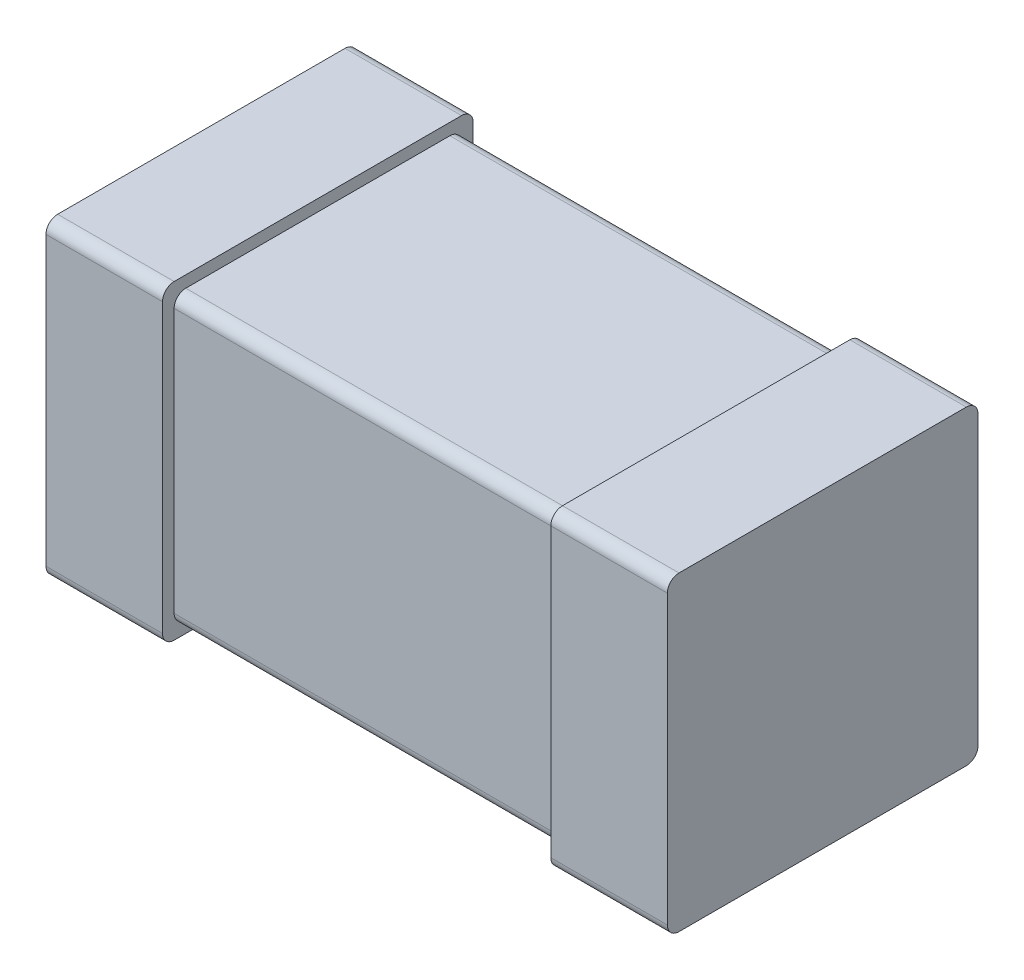
ISO-10303-21;
HEADER;
FILE_DESCRIPTION(('STEP AP214'),'2;1');
FILE_NAME('part.step','',(''),(''),'','','');
FILE_SCHEMA(('AUTOMOTIVE_DESIGN { 1 0 10303 214 1 1 1 1 }'));
ENDSEC;
DATA;
#1=APPLICATION_CONTEXT('core data for automotive mechanical design processes');
#2=APPLICATION_PROTOCOL_DEFINITION('international standard','automotive_design',2000,#1);
#3=PRODUCT_CONTEXT('',#1,'mechanical');
#4=PRODUCT('Part','Part','',(#3));
#5=PRODUCT_RELATED_PRODUCT_CATEGORY('part','',(#4));
#6=PRODUCT_DEFINITION_FORMATION('','',#4);
#7=PRODUCT_DEFINITION_CONTEXT('part definition',#1,'design');
#8=PRODUCT_DEFINITION('design','',#6,#7);
#9=PRODUCT_DEFINITION_SHAPE('','',#8);
#10=(LENGTH_UNIT() NAMED_UNIT(*) SI_UNIT(.MILLI.,.METRE.));
#11=(NAMED_UNIT(*) PLANE_ANGLE_UNIT() SI_UNIT($,.RADIAN.));
#12=(NAMED_UNIT(*) SI_UNIT($,.STERADIAN.) SOLID_ANGLE_UNIT());
#13=UNCERTAINTY_MEASURE_WITH_UNIT(LENGTH_MEASURE(1.E-05),#10,'distance_accuracy_value','');
#14=(GEOMETRIC_REPRESENTATION_CONTEXT(3) GLOBAL_UNCERTAINTY_ASSIGNED_CONTEXT((#13)) GLOBAL_UNIT_ASSIGNED_CONTEXT((#10,
#11,#12)) REPRESENTATION_CONTEXT('',''));
#15=CARTESIAN_POINT('',(0.,0.,0.));
#16=DIRECTION('',(0.,0.,1.));
#17=DIRECTION('',(1.,0.,0.));
#18=AXIS2_PLACEMENT_3D('',#15,#16,#17);
#19=CARTESIAN_POINT('',(0.8,-0.4,0.));
#20=DIRECTION('',(1.,0.,0.));
#21=DIRECTION('',(0.,1.,0.));
#22=AXIS2_PLACEMENT_3D('',#19,#20,#21);
#23=PLANE('',#22);
#24=DIRECTION('',(0.,0.,1.));
#25=VECTOR('',#24,1.);
#26=CARTESIAN_POINT('',(0.8,-0.4,0.));
#27=LINE('',#26,#25);
#28=CARTESIAN_POINT('',(0.8,-0.4,0.03));
#29=VERTEX_POINT('',#28);
#30=CARTESIAN_POINT('',(0.8,-0.4,0.77));
#31=VERTEX_POINT('',#30);
#32=EDGE_CURVE('E292',#29,#31,#27,.T.);
#33=ORIENTED_EDGE('',*,*,#32,.F.);
#34=CARTESIAN_POINT('',(0.8,-0.37,0.03));
#35=DIRECTION('',(1.,0.,0.));
#36=DIRECTION('',(0.,0.,1.));
#37=AXIS2_PLACEMENT_3D('',#34,#35,#36);
#38=CIRCLE('',#37,0.03);
#39=CARTESIAN_POINT('',(0.8,-0.37,0.));
#40=VERTEX_POINT('',#39);
#41=EDGE_CURVE('E297',#29,#40,#38,.T.);
#42=ORIENTED_EDGE('',*,*,#41,.T.);
#43=DIRECTION('',(0.,1.,0.));
#44=VECTOR('',#43,1.);
#45=CARTESIAN_POINT('',(0.8,-0.4,0.));
#46=LINE('',#45,#44);
#47=CARTESIAN_POINT('',(0.8,0.37,0.));
#48=VERTEX_POINT('',#47);
#49=EDGE_CURVE('E310',#40,#48,#46,.T.);
#50=ORIENTED_EDGE('',*,*,#49,.T.);
#51=CARTESIAN_POINT('',(0.8,0.37,0.03));
#52=DIRECTION('',(-1.,0.,0.));
#53=DIRECTION('',(0.,0.,1.));
#54=AXIS2_PLACEMENT_3D('',#51,#52,#53);
#55=CIRCLE('',#54,0.03);
#56=CARTESIAN_POINT('',(0.8,0.4,0.03));
#57=VERTEX_POINT('',#56);
#58=EDGE_CURVE('E320',#57,#48,#55,.T.);
#59=ORIENTED_EDGE('',*,*,#58,.F.);
#60=DIRECTION('',(0.,0.,1.));
#61=VECTOR('',#60,1.);
#62=CARTESIAN_POINT('',(0.8,0.4,0.));
#63=LINE('',#62,#61);
#64=CARTESIAN_POINT('',(0.8,0.4,0.77));
#65=VERTEX_POINT('',#64);
#66=EDGE_CURVE('E11',#57,#65,#63,.T.);
#67=ORIENTED_EDGE('',*,*,#66,.T.);
#68=CARTESIAN_POINT('',(0.8,0.37,0.77));
#69=DIRECTION('',(1.,0.,0.));
#70=DIRECTION('',(0.,0.,1.));
#71=AXIS2_PLACEMENT_3D('',#68,#69,#70);
#72=CIRCLE('',#71,0.03);
#73=CARTESIAN_POINT('',(0.8,0.37,0.8));
#74=VERTEX_POINT('',#73);
#75=EDGE_CURVE('E322',#65,#74,#72,.T.);
#76=ORIENTED_EDGE('',*,*,#75,.T.);
#77=DIRECTION('',(0.,1.,0.));
#78=VECTOR('',#77,1.);
#79=CARTESIAN_POINT('',(0.8,-0.4,0.8));
#80=LINE('',#79,#78);
#81=CARTESIAN_POINT('',(0.8,-0.37,0.8));
#82=VERTEX_POINT('',#81);
#83=EDGE_CURVE('E316',#82,#74,#80,.T.);
#84=ORIENTED_EDGE('',*,*,#83,.F.);
#85=CARTESIAN_POINT('',(0.8,-0.37,0.77));
#86=DIRECTION('',(-1.,0.,0.));
#87=DIRECTION('',(0.,0.,1.));
#88=AXIS2_PLACEMENT_3D('',#85,#86,#87);
#89=CIRCLE('',#88,0.03);
#90=EDGE_CURVE('E301',#31,#82,#89,.T.);
#91=ORIENTED_EDGE('',*,*,#90,.F.);
#92=EDGE_LOOP('',(#33,#42,#50,#59,#67,#76,#84,#91));
#93=FACE_BOUND('',#92,.T.);
#94=ADVANCED_FACE('F17',(#93),#23,.T.);
#95=CARTESIAN_POINT('',(0.5,0.4,0.));
#96=DIRECTION('',(0.,1.,0.));
#97=DIRECTION('',(1.,0.,0.));
#98=AXIS2_PLACEMENT_3D('',#95,#96,#97);
#99=PLANE('',#98);
#100=ORIENTED_EDGE('',*,*,#66,.F.);
#101=DIRECTION('',(1.,0.,0.));
#102=VECTOR('',#101,1.);
#103=CARTESIAN_POINT('',(0.5,0.4,0.03));
#104=LINE('',#103,#102);
#105=CARTESIAN_POINT('',(0.5,0.4,0.03));
#106=VERTEX_POINT('',#105);
#107=EDGE_CURVE('E315',#106,#57,#104,.T.);
#108=ORIENTED_EDGE('',*,*,#107,.F.);
#109=DIRECTION('',(0.,0.,1.));
#110=VECTOR('',#109,1.);
#111=CARTESIAN_POINT('',(0.5,0.4,0.));
#112=LINE('',#111,#110);
#113=CARTESIAN_POINT('',(0.5,0.4,0.77));
#114=VERTEX_POINT('',#113);
#115=EDGE_CURVE('E273',#106,#114,#112,.T.);
#116=ORIENTED_EDGE('',*,*,#115,.T.);
#117=DIRECTION('',(1.,0.,0.));
#118=VECTOR('',#117,1.);
#119=CARTESIAN_POINT('',(0.5,0.4,0.77));
#120=LINE('',#119,#118);
#121=EDGE_CURVE('E21',#114,#65,#120,.T.);
#122=ORIENTED_EDGE('',*,*,#121,.T.);
#123=EDGE_LOOP('',(#100,#108,#116,#122));
#124=FACE_BOUND('',#123,.T.);
#125=ADVANCED_FACE('F19',(#124),#99,.T.);
#126=CARTESIAN_POINT('',(0.5,0.37,0.77));
#127=DIRECTION('',(1.,0.,0.));
#128=DIRECTION('',(0.,1.,0.));
#129=AXIS2_PLACEMENT_3D('',#126,#127,#128);
#130=CYLINDRICAL_SURFACE('',#129,0.03);
#131=CARTESIAN_POINT('',(0.5,0.37,0.77));
#132=DIRECTION('',(1.,0.,0.));
#133=DIRECTION('',(0.,0.,1.));
#134=AXIS2_PLACEMENT_3D('',#131,#132,#133);
#135=CIRCLE('',#134,0.03);
#136=CARTESIAN_POINT('',(0.5,0.37,0.8));
#137=VERTEX_POINT('',#136);
#138=EDGE_CURVE('E272',#114,#137,#135,.T.);
#139=ORIENTED_EDGE('',*,*,#138,.T.);
#140=DIRECTION('',(1.,0.,0.));
#141=VECTOR('',#140,1.);
#142=CARTESIAN_POINT('',(0.5,0.37,0.8));
#143=LINE('',#142,#141);
#144=EDGE_CURVE('E311',#137,#74,#143,.T.);
#145=ORIENTED_EDGE('',*,*,#144,.T.);
#146=ORIENTED_EDGE('',*,*,#75,.F.);
#147=ORIENTED_EDGE('',*,*,#121,.F.);
#148=EDGE_LOOP('',(#139,#145,#146,#147));
#149=FACE_BOUND('',#148,.T.);
#150=ADVANCED_FACE('F333',(#149),#130,.T.);
#151=CARTESIAN_POINT('',(0.5,0.37,0.03));
#152=DIRECTION('',(1.,0.,0.));
#153=DIRECTION('',(0.,1.,0.));
#154=AXIS2_PLACEMENT_3D('',#151,#152,#153);
#155=CYLINDRICAL_SURFACE('',#154,0.03);
#156=ORIENTED_EDGE('',*,*,#107,.T.);
#157=ORIENTED_EDGE('',*,*,#58,.T.);
#158=DIRECTION('',(1.,0.,0.));
#159=VECTOR('',#158,1.);
#160=CARTESIAN_POINT('',(0.5,0.37,0.));
#161=LINE('',#160,#159);
#162=CARTESIAN_POINT('',(0.5,0.37,0.));
#163=VERTEX_POINT('',#162);
#164=EDGE_CURVE('E306',#163,#48,#161,.T.);
#165=ORIENTED_EDGE('',*,*,#164,.F.);
#166=CARTESIAN_POINT('',(0.5,0.37,0.03));
#167=DIRECTION('',(-1.,0.,0.));
#168=DIRECTION('',(0.,0.,1.));
#169=AXIS2_PLACEMENT_3D('',#166,#167,#168);
#170=CIRCLE('',#169,0.03);
#171=EDGE_CURVE('E277',#106,#163,#170,.T.);
#172=ORIENTED_EDGE('',*,*,#171,.F.);
#173=EDGE_LOOP('',(#156,#157,#165,#172));
#174=FACE_BOUND('',#173,.T.);
#175=ADVANCED_FACE('F618',(#174),#155,.T.);
#176=CARTESIAN_POINT('',(0.5,-0.4,0.8));
#177=DIRECTION('',(0.,0.,1.));
#178=DIRECTION('',(1.,0.,0.));
#179=AXIS2_PLACEMENT_3D('',#176,#177,#178);
#180=PLANE('',#179);
#181=DIRECTION('',(0.,1.,0.));
#182=VECTOR('',#181,1.);
#183=CARTESIAN_POINT('',(0.5,-0.4,0.8));
#184=LINE('',#183,#182);
#185=CARTESIAN_POINT('',(0.5,-0.37,0.8));
#186=VERTEX_POINT('',#185);
#187=EDGE_CURVE('E268',#186,#137,#184,.T.);
#188=ORIENTED_EDGE('',*,*,#187,.F.);
#189=DIRECTION('',(1.,0.,0.));
#190=VECTOR('',#189,1.);
#191=CARTESIAN_POINT('',(0.5,-0.37,0.8));
#192=LINE('',#191,#190);
#193=EDGE_CURVE('E305',#186,#82,#192,.T.);
#194=ORIENTED_EDGE('',*,*,#193,.T.);
#195=ORIENTED_EDGE('',*,*,#83,.T.);
#196=ORIENTED_EDGE('',*,*,#144,.F.);
#197=EDGE_LOOP('',(#188,#194,#195,#196));
#198=FACE_BOUND('',#197,.T.);
#199=ADVANCED_FACE('F338',(#198),#180,.T.);
#200=CARTESIAN_POINT('',(0.5,-0.4,0.));
#201=DIRECTION('',(0.,0.,1.));
#202=DIRECTION('',(1.,0.,0.));
#203=AXIS2_PLACEMENT_3D('',#200,#201,#202);
#204=PLANE('',#203);
#205=ORIENTED_EDGE('',*,*,#164,.T.);
#206=ORIENTED_EDGE('',*,*,#49,.F.);
#207=DIRECTION('',(1.,0.,0.));
#208=VECTOR('',#207,1.);
#209=CARTESIAN_POINT('',(0.5,-0.37,0.));
#210=LINE('',#209,#208);
#211=CARTESIAN_POINT('',(0.5,-0.37,0.));
#212=VERTEX_POINT('',#211);
#213=EDGE_CURVE('E296',#212,#40,#210,.T.);
#214=ORIENTED_EDGE('',*,*,#213,.F.);
#215=DIRECTION('',(0.,1.,0.));
#216=VECTOR('',#215,1.);
#217=CARTESIAN_POINT('',(0.5,-0.4,0.));
#218=LINE('',#217,#216);
#219=EDGE_CURVE('E283',#212,#163,#218,.T.);
#220=ORIENTED_EDGE('',*,*,#219,.T.);
#221=EDGE_LOOP('',(#205,#206,#214,#220));
#222=FACE_BOUND('',#221,.T.);
#223=ADVANCED_FACE('F612',(#222),#204,.F.);
#224=CARTESIAN_POINT('',(0.5,-0.37,0.77));
#225=DIRECTION('',(1.,0.,0.));
#226=DIRECTION('',(0.,-1.,0.));
#227=AXIS2_PLACEMENT_3D('',#224,#225,#226);
#228=CYLINDRICAL_SURFACE('',#227,0.03);
#229=DIRECTION('',(1.,0.,0.));
#230=VECTOR('',#229,1.);
#231=CARTESIAN_POINT('',(0.5,-0.4,0.77));
#232=LINE('',#231,#230);
#233=CARTESIAN_POINT('',(0.5,-0.4,0.77));
#234=VERTEX_POINT('',#233);
#235=EDGE_CURVE('E287',#234,#31,#232,.T.);
#236=ORIENTED_EDGE('',*,*,#235,.T.);
#237=ORIENTED_EDGE('',*,*,#90,.T.);
#238=ORIENTED_EDGE('',*,*,#193,.F.);
#239=CARTESIAN_POINT('',(0.5,-0.37,0.77));
#240=DIRECTION('',(-1.,0.,0.));
#241=DIRECTION('',(0.,0.,1.));
#242=AXIS2_PLACEMENT_3D('',#239,#240,#241);
#243=CIRCLE('',#242,0.03);
#244=EDGE_CURVE('E267',#234,#186,#243,.T.);
#245=ORIENTED_EDGE('',*,*,#244,.F.);
#246=EDGE_LOOP('',(#236,#237,#238,#245));
#247=FACE_BOUND('',#246,.T.);
#248=ADVANCED_FACE('F608',(#247),#228,.T.);
#249=CARTESIAN_POINT('',(0.5,-0.37,0.03));
#250=DIRECTION('',(1.,0.,0.));
#251=DIRECTION('',(0.,-1.,0.));
#252=AXIS2_PLACEMENT_3D('',#249,#250,#251);
#253=CYLINDRICAL_SURFACE('',#252,0.03);
#254=CARTESIAN_POINT('',(0.5,-0.37,0.03));
#255=DIRECTION('',(1.,0.,0.));
#256=DIRECTION('',(0.,0.,1.));
#257=AXIS2_PLACEMENT_3D('',#254,#255,#256);
#258=CIRCLE('',#257,0.03);
#259=CARTESIAN_POINT('',(0.5,-0.4,0.03));
#260=VERTEX_POINT('',#259);
#261=EDGE_CURVE('E278',#260,#212,#258,.T.);
#262=ORIENTED_EDGE('',*,*,#261,.T.);
#263=ORIENTED_EDGE('',*,*,#213,.T.);
#264=ORIENTED_EDGE('',*,*,#41,.F.);
#265=DIRECTION('',(1.,0.,0.));
#266=VECTOR('',#265,1.);
#267=CARTESIAN_POINT('',(0.5,-0.4,0.03));
#268=LINE('',#267,#266);
#269=EDGE_CURVE('E288',#260,#29,#268,.T.);
#270=ORIENTED_EDGE('',*,*,#269,.F.);
#271=EDGE_LOOP('',(#262,#263,#264,#270));
#272=FACE_BOUND('',#271,.T.);
#273=ADVANCED_FACE('F605',(#272),#253,.T.);
#274=CARTESIAN_POINT('',(0.5,-0.4,0.));
#275=DIRECTION('',(0.,1.,0.));
#276=DIRECTION('',(1.,0.,0.));
#277=AXIS2_PLACEMENT_3D('',#274,#275,#276);
#278=PLANE('',#277);
#279=ORIENTED_EDGE('',*,*,#235,.F.);
#280=DIRECTION('',(0.,0.,1.));
#281=VECTOR('',#280,1.);
#282=CARTESIAN_POINT('',(0.5,-0.4,0.));
#283=LINE('',#282,#281);
#284=EDGE_CURVE('E282',#260,#234,#283,.T.);
#285=ORIENTED_EDGE('',*,*,#284,.F.);
#286=ORIENTED_EDGE('',*,*,#269,.T.);
#287=ORIENTED_EDGE('',*,*,#32,.T.);
#288=EDGE_LOOP('',(#279,#285,#286,#287));
#289=FACE_BOUND('',#288,.T.);
#290=ADVANCED_FACE('F604',(#289),#278,.F.);
#291=CARTESIAN_POINT('',(0.5,-0.4,0.));
#292=DIRECTION('',(1.,0.,0.));
#293=DIRECTION('',(0.,1.,0.));
#294=AXIS2_PLACEMENT_3D('',#291,#292,#293);
#295=PLANE('',#294);
#296=DIRECTION('',(0.,1.,0.));
#297=VECTOR('',#296,1.);
#298=CARTESIAN_POINT('',(0.5,-0.37,0.03));
#299=LINE('',#298,#297);
#300=CARTESIAN_POINT('',(0.5,-0.34,0.03));
#301=VERTEX_POINT('',#300);
#302=CARTESIAN_POINT('',(0.5,0.34,0.03));
#303=VERTEX_POINT('',#302);
#304=EDGE_CURVE('E452',#301,#303,#299,.T.);
#305=ORIENTED_EDGE('',*,*,#304,.T.);
#306=CARTESIAN_POINT('',(0.5,0.34,0.06));
#307=DIRECTION('',(-1.,0.,0.));
#308=DIRECTION('',(0.,0.,1.));
#309=AXIS2_PLACEMENT_3D('',#306,#307,#308);
#310=CIRCLE('',#309,0.03);
#311=CARTESIAN_POINT('',(0.5,0.37,0.06));
#312=VERTEX_POINT('',#311);
#313=EDGE_CURVE('E459',#312,#303,#310,.T.);
#314=ORIENTED_EDGE('',*,*,#313,.F.);
#315=DIRECTION('',(0.,0.,1.));
#316=VECTOR('',#315,1.);
#317=CARTESIAN_POINT('',(0.5,0.37,0.03));
#318=LINE('',#317,#316);
#319=CARTESIAN_POINT('',(0.5,0.37,0.74));
#320=VERTEX_POINT('',#319);
#321=EDGE_CURVE('E462',#312,#320,#318,.T.);
#322=ORIENTED_EDGE('',*,*,#321,.T.);
#323=CARTESIAN_POINT('',(0.5,0.34,0.74));
#324=DIRECTION('',(1.,0.,0.));
#325=DIRECTION('',(0.,0.,1.));
#326=AXIS2_PLACEMENT_3D('',#323,#324,#325);
#327=CIRCLE('',#326,0.03);
#328=CARTESIAN_POINT('',(0.5,0.34,0.77));
#329=VERTEX_POINT('',#328);
#330=EDGE_CURVE('E247',#320,#329,#327,.T.);
#331=ORIENTED_EDGE('',*,*,#330,.T.);
#332=DIRECTION('',(0.,1.,0.));
#333=VECTOR('',#332,1.);
#334=CARTESIAN_POINT('',(0.5,-0.37,0.77));
#335=LINE('',#334,#333);
#336=CARTESIAN_POINT('',(0.5,-0.34,0.77));
#337=VERTEX_POINT('',#336);
#338=EDGE_CURVE('E242',#337,#329,#335,.T.);
#339=ORIENTED_EDGE('',*,*,#338,.F.);
#340=CARTESIAN_POINT('',(0.5,-0.34,0.74));
#341=DIRECTION('',(-1.,0.,0.));
#342=DIRECTION('',(0.,0.,1.));
#343=AXIS2_PLACEMENT_3D('',#340,#341,#342);
#344=CIRCLE('',#343,0.03);
#345=CARTESIAN_POINT('',(0.5,-0.37,0.74));
#346=VERTEX_POINT('',#345);
#347=EDGE_CURVE('E229',#346,#337,#344,.T.);
#348=ORIENTED_EDGE('',*,*,#347,.F.);
#349=DIRECTION('',(0.,0.,1.));
#350=VECTOR('',#349,1.);
#351=CARTESIAN_POINT('',(0.5,-0.37,0.03));
#352=LINE('',#351,#350);
#353=CARTESIAN_POINT('',(0.5,-0.37,0.06));
#354=VERTEX_POINT('',#353);
#355=EDGE_CURVE('E239',#354,#346,#352,.T.);
#356=ORIENTED_EDGE('',*,*,#355,.F.);
#357=CARTESIAN_POINT('',(0.5,-0.34,0.06));
#358=DIRECTION('',(1.,0.,0.));
#359=DIRECTION('',(0.,0.,1.));
#360=AXIS2_PLACEMENT_3D('',#357,#358,#359);
#361=CIRCLE('',#360,0.03);
#362=EDGE_CURVE('E437',#354,#301,#361,.T.);
#363=ORIENTED_EDGE('',*,*,#362,.T.);
#364=EDGE_LOOP('',(#305,#314,#322,#331,#339,#348,#356,#363));
#365=FACE_BOUND('',#364,.T.);
#366=ORIENTED_EDGE('',*,*,#244,.T.);
#367=ORIENTED_EDGE('',*,*,#187,.T.);
#368=ORIENTED_EDGE('',*,*,#138,.F.);
#369=ORIENTED_EDGE('',*,*,#115,.F.);
#370=ORIENTED_EDGE('',*,*,#171,.T.);
#371=ORIENTED_EDGE('',*,*,#219,.F.);
#372=ORIENTED_EDGE('',*,*,#261,.F.);
#373=ORIENTED_EDGE('',*,*,#284,.T.);
#374=EDGE_LOOP('',(#366,#367,#368,#369,#370,#371,#372,#373));
#375=FACE_BOUND('',#374,.T.);
#376=ADVANCED_FACE('F244',(#365,#375),#295,.F.);
#377=CARTESIAN_POINT('',(-0.5,-0.37,0.03));
#378=DIRECTION('',(0.,1.,0.));
#379=DIRECTION('',(1.,0.,0.));
#380=AXIS2_PLACEMENT_3D('',#377,#378,#379);
#381=PLANE('',#380);
#382=DIRECTION('',(1.,0.,0.));
#383=VECTOR('',#382,1.);
#384=CARTESIAN_POINT('',(-0.5,-0.37,0.74));
#385=LINE('',#384,#383);
#386=CARTESIAN_POINT('',(-0.5,-0.37,0.74));
#387=VERTEX_POINT('',#386);
#388=EDGE_CURVE('E236',#387,#346,#385,.T.);
#389=ORIENTED_EDGE('',*,*,#388,.F.);
#390=DIRECTION('',(0.,0.,1.));
#391=VECTOR('',#390,1.);
#392=CARTESIAN_POINT('',(-0.5,-0.37,0.03));
#393=LINE('',#392,#391);
#394=CARTESIAN_POINT('',(-0.5,-0.37,0.06));
#395=VERTEX_POINT('',#394);
#396=EDGE_CURVE('E401',#395,#387,#393,.T.);
#397=ORIENTED_EDGE('',*,*,#396,.F.);
#398=DIRECTION('',(1.,0.,0.));
#399=VECTOR('',#398,1.);
#400=CARTESIAN_POINT('',(-0.5,-0.37,0.06));
#401=LINE('',#400,#399);
#402=EDGE_CURVE('E441',#395,#354,#401,.T.);
#403=ORIENTED_EDGE('',*,*,#402,.T.);
#404=ORIENTED_EDGE('',*,*,#355,.T.);
#405=EDGE_LOOP('',(#389,#397,#403,#404));
#406=FACE_BOUND('',#405,.T.);
#407=ADVANCED_FACE('F598',(#406),#381,.F.);
#408=CARTESIAN_POINT('',(-0.5,-0.34,0.74));
#409=DIRECTION('',(1.,0.,0.));
#410=DIRECTION('',(0.,-1.,0.));
#411=AXIS2_PLACEMENT_3D('',#408,#409,#410);
#412=CYLINDRICAL_SURFACE('',#411,0.03);
#413=ORIENTED_EDGE('',*,*,#388,.T.);
#414=ORIENTED_EDGE('',*,*,#347,.T.);
#415=DIRECTION('',(1.,0.,0.));
#416=VECTOR('',#415,1.);
#417=CARTESIAN_POINT('',(-0.5,-0.34,0.77));
#418=LINE('',#417,#416);
#419=CARTESIAN_POINT('',(-0.5,-0.34,0.77));
#420=VERTEX_POINT('',#419);
#421=EDGE_CURVE('E234',#420,#337,#418,.T.);
#422=ORIENTED_EDGE('',*,*,#421,.F.);
#423=CARTESIAN_POINT('',(-0.5,-0.34,0.74));
#424=DIRECTION('',(-1.,0.,0.));
#425=DIRECTION('',(0.,0.,1.));
#426=AXIS2_PLACEMENT_3D('',#423,#424,#425);
#427=CIRCLE('',#426,0.03);
#428=EDGE_CURVE('E398',#387,#420,#427,.T.);
#429=ORIENTED_EDGE('',*,*,#428,.F.);
#430=EDGE_LOOP('',(#413,#414,#422,#429));
#431=FACE_BOUND('',#430,.T.);
#432=ADVANCED_FACE('F231',(#431),#412,.T.);
#433=CARTESIAN_POINT('',(-0.5,-0.37,0.77));
#434=DIRECTION('',(0.,0.,1.));
#435=DIRECTION('',(1.,0.,0.));
#436=AXIS2_PLACEMENT_3D('',#433,#434,#435);
#437=PLANE('',#436);
#438=DIRECTION('',(0.,1.,0.));
#439=VECTOR('',#438,1.);
#440=CARTESIAN_POINT('',(-0.5,-0.37,0.77));
#441=LINE('',#440,#439);
#442=CARTESIAN_POINT('',(-0.5,0.34,0.77));
#443=VERTEX_POINT('',#442);
#444=EDGE_CURVE('E254',#420,#443,#441,.T.);
#445=ORIENTED_EDGE('',*,*,#444,.F.);
#446=ORIENTED_EDGE('',*,*,#421,.T.);
#447=ORIENTED_EDGE('',*,*,#338,.T.);
#448=DIRECTION('',(1.,0.,0.));
#449=VECTOR('',#448,1.);
#450=CARTESIAN_POINT('',(-0.5,0.34,0.77));
#451=LINE('',#450,#449);
#452=EDGE_CURVE('E262',#443,#329,#451,.T.);
#453=ORIENTED_EDGE('',*,*,#452,.F.);
#454=EDGE_LOOP('',(#445,#446,#447,#453));
#455=FACE_BOUND('',#454,.T.);
#456=ADVANCED_FACE('F252',(#455),#437,.T.);
#457=CARTESIAN_POINT('',(-0.5,0.34,0.74));
#458=DIRECTION('',(1.,0.,0.));
#459=DIRECTION('',(0.,1.,0.));
#460=AXIS2_PLACEMENT_3D('',#457,#458,#459);
#461=CYLINDRICAL_SURFACE('',#460,0.03);
#462=CARTESIAN_POINT('',(-0.5,0.34,0.74));
#463=DIRECTION('',(1.,0.,0.));
#464=DIRECTION('',(0.,0.,1.));
#465=AXIS2_PLACEMENT_3D('',#462,#463,#464);
#466=CIRCLE('',#465,0.03);
#467=CARTESIAN_POINT('',(-0.5,0.37,0.74));
#468=VERTEX_POINT('',#467);
#469=EDGE_CURVE('E425',#468,#443,#466,.T.);
#470=ORIENTED_EDGE('',*,*,#469,.T.);
#471=ORIENTED_EDGE('',*,*,#452,.T.);
#472=ORIENTED_EDGE('',*,*,#330,.F.);
#473=DIRECTION('',(1.,0.,0.));
#474=VECTOR('',#473,1.);
#475=CARTESIAN_POINT('',(-0.5,0.37,0.74));
#476=LINE('',#475,#474);
#477=EDGE_CURVE('E467',#468,#320,#476,.T.);
#478=ORIENTED_EDGE('',*,*,#477,.F.);
#479=EDGE_LOOP('',(#470,#471,#472,#478));
#480=FACE_BOUND('',#479,.T.);
#481=ADVANCED_FACE('F478',(#480),#461,.T.);
#482=CARTESIAN_POINT('',(-0.5,0.37,0.03));
#483=DIRECTION('',(0.,1.,0.));
#484=DIRECTION('',(1.,0.,0.));
#485=AXIS2_PLACEMENT_3D('',#482,#483,#484);
#486=PLANE('',#485);
#487=ORIENTED_EDGE('',*,*,#321,.F.);
#488=DIRECTION('',(1.,0.,0.));
#489=VECTOR('',#488,1.);
#490=CARTESIAN_POINT('',(-0.5,0.37,0.06));
#491=LINE('',#490,#489);
#492=CARTESIAN_POINT('',(-0.5,0.37,0.06));
#493=VERTEX_POINT('',#492);
#494=EDGE_CURVE('E455',#493,#312,#491,.T.);
#495=ORIENTED_EDGE('',*,*,#494,.F.);
#496=DIRECTION('',(0.,0.,1.));
#497=VECTOR('',#496,1.);
#498=CARTESIAN_POINT('',(-0.5,0.37,0.03));
#499=LINE('',#498,#497);
#500=EDGE_CURVE('E420',#493,#468,#499,.T.);
#501=ORIENTED_EDGE('',*,*,#500,.T.);
#502=ORIENTED_EDGE('',*,*,#477,.T.);
#503=EDGE_LOOP('',(#487,#495,#501,#502));
#504=FACE_BOUND('',#503,.T.);
#505=ADVANCED_FACE('F695',(#504),#486,.T.);
#506=CARTESIAN_POINT('',(-0.5,0.34,0.06));
#507=DIRECTION('',(1.,0.,0.));
#508=DIRECTION('',(0.,1.,0.));
#509=AXIS2_PLACEMENT_3D('',#506,#507,#508);
#510=CYLINDRICAL_SURFACE('',#509,0.03);
#511=ORIENTED_EDGE('',*,*,#494,.T.);
#512=ORIENTED_EDGE('',*,*,#313,.T.);
#513=DIRECTION('',(1.,0.,0.));
#514=VECTOR('',#513,1.);
#515=CARTESIAN_POINT('',(-0.5,0.34,0.03));
#516=LINE('',#515,#514);
#517=CARTESIAN_POINT('',(-0.5,0.34,0.03));
#518=VERTEX_POINT('',#517);
#519=EDGE_CURVE('E448',#518,#303,#516,.T.);
#520=ORIENTED_EDGE('',*,*,#519,.F.);
#521=CARTESIAN_POINT('',(-0.5,0.34,0.06));
#522=DIRECTION('',(-1.,0.,0.));
#523=DIRECTION('',(0.,0.,1.));
#524=AXIS2_PLACEMENT_3D('',#521,#522,#523);
#525=CIRCLE('',#524,0.03);
#526=EDGE_CURVE('E424',#493,#518,#525,.T.);
#527=ORIENTED_EDGE('',*,*,#526,.F.);
#528=EDGE_LOOP('',(#511,#512,#520,#527));
#529=FACE_BOUND('',#528,.T.);
#530=ADVANCED_FACE('F585',(#529),#510,.T.);
#531=CARTESIAN_POINT('',(-0.5,-0.37,0.03));
#532=DIRECTION('',(0.,0.,1.));
#533=DIRECTION('',(1.,0.,0.));
#534=AXIS2_PLACEMENT_3D('',#531,#532,#533);
#535=PLANE('',#534);
#536=ORIENTED_EDGE('',*,*,#519,.T.);
#537=ORIENTED_EDGE('',*,*,#304,.F.);
#538=DIRECTION('',(1.,0.,0.));
#539=VECTOR('',#538,1.);
#540=CARTESIAN_POINT('',(-0.5,-0.34,0.03));
#541=LINE('',#540,#539);
#542=CARTESIAN_POINT('',(-0.5,-0.34,0.03));
#543=VERTEX_POINT('',#542);
#544=EDGE_CURVE('E433',#543,#301,#541,.T.);
#545=ORIENTED_EDGE('',*,*,#544,.F.);
#546=DIRECTION('',(0.,1.,0.));
#547=VECTOR('',#546,1.);
#548=CARTESIAN_POINT('',(-0.5,-0.37,0.03));
#549=LINE('',#548,#547);
#550=EDGE_CURVE('E429',#543,#518,#549,.T.);
#551=ORIENTED_EDGE('',*,*,#550,.T.);
#552=EDGE_LOOP('',(#536,#537,#545,#551));
#553=FACE_BOUND('',#552,.T.);
#554=ADVANCED_FACE('F589',(#553),#535,.F.);
#555=CARTESIAN_POINT('',(-0.5,-0.34,0.06));
#556=DIRECTION('',(1.,0.,0.));
#557=DIRECTION('',(0.,-1.,0.));
#558=AXIS2_PLACEMENT_3D('',#555,#556,#557);
#559=CYLINDRICAL_SURFACE('',#558,0.03);
#560=CARTESIAN_POINT('',(-0.5,-0.34,0.06));
#561=DIRECTION('',(1.,0.,0.));
#562=DIRECTION('',(0.,0.,1.));
#563=AXIS2_PLACEMENT_3D('',#560,#561,#562);
#564=CIRCLE('',#563,0.03);
#565=EDGE_CURVE('E411',#395,#543,#564,.T.);
#566=ORIENTED_EDGE('',*,*,#565,.T.);
#567=ORIENTED_EDGE('',*,*,#544,.T.);
#568=ORIENTED_EDGE('',*,*,#362,.F.);
#569=ORIENTED_EDGE('',*,*,#402,.F.);
#570=EDGE_LOOP('',(#566,#567,#568,#569));
#571=FACE_BOUND('',#570,.T.);
#572=ADVANCED_FACE('F592',(#571),#559,.T.);
#573=CARTESIAN_POINT('',(-0.5,-0.4,0.));
#574=DIRECTION('',(1.,0.,0.));
#575=DIRECTION('',(0.,1.,0.));
#576=AXIS2_PLACEMENT_3D('',#573,#574,#575);
#577=PLANE('',#576);
#578=ORIENTED_EDGE('',*,*,#565,.F.);
#579=ORIENTED_EDGE('',*,*,#396,.T.);
#580=ORIENTED_EDGE('',*,*,#428,.T.);
#581=ORIENTED_EDGE('',*,*,#444,.T.);
#582=ORIENTED_EDGE('',*,*,#469,.F.);
#583=ORIENTED_EDGE('',*,*,#500,.F.);
#584=ORIENTED_EDGE('',*,*,#526,.T.);
#585=ORIENTED_EDGE('',*,*,#550,.F.);
#586=EDGE_LOOP('',(#578,#579,#580,#581,#582,#583,#584,#585));
#587=FACE_BOUND('',#586,.T.);
#588=DIRECTION('',(0.,0.,1.));
#589=VECTOR('',#588,1.);
#590=CARTESIAN_POINT('',(-0.5,-0.4,0.));
#591=LINE('',#590,#589);
#592=CARTESIAN_POINT('',(-0.5,-0.4,0.03));
#593=VERTEX_POINT('',#592);
#594=CARTESIAN_POINT('',(-0.5,-0.4,0.77));
#595=VERTEX_POINT('',#594);
#596=EDGE_CURVE('E351',#593,#595,#591,.T.);
#597=ORIENTED_EDGE('',*,*,#596,.F.);
#598=CARTESIAN_POINT('',(-0.5,-0.37,0.03));
#599=DIRECTION('',(1.,0.,0.));
#600=DIRECTION('',(0.,0.,1.));
#601=AXIS2_PLACEMENT_3D('',#598,#599,#600);
#602=CIRCLE('',#601,0.03);
#603=CARTESIAN_POINT('',(-0.5,-0.37,0.));
#604=VERTEX_POINT('',#603);
#605=EDGE_CURVE('E359',#593,#604,#602,.T.);
#606=ORIENTED_EDGE('',*,*,#605,.T.);
#607=DIRECTION('',(0.,1.,0.));
#608=VECTOR('',#607,1.);
#609=CARTESIAN_POINT('',(-0.5,-0.4,0.));
#610=LINE('',#609,#608);
#611=CARTESIAN_POINT('',(-0.5,0.37,0.));
#612=VERTEX_POINT('',#611);
#613=EDGE_CURVE('E381',#604,#612,#610,.T.);
#614=ORIENTED_EDGE('',*,*,#613,.T.);
#615=CARTESIAN_POINT('',(-0.5,0.37,0.03));
#616=DIRECTION('',(-1.,0.,0.));
#617=DIRECTION('',(0.,0.,1.));
#618=AXIS2_PLACEMENT_3D('',#615,#616,#617);
#619=CIRCLE('',#618,0.03);
#620=CARTESIAN_POINT('',(-0.5,0.4,0.03));
#621=VERTEX_POINT('',#620);
#622=EDGE_CURVE('E379',#621,#612,#619,.T.);
#623=ORIENTED_EDGE('',*,*,#622,.F.);
#624=DIRECTION('',(0.,0.,1.));
#625=VECTOR('',#624,1.);
#626=CARTESIAN_POINT('',(-0.5,0.4,0.));
#627=LINE('',#626,#625);
#628=CARTESIAN_POINT('',(-0.5,0.4,0.77));
#629=VERTEX_POINT('',#628);
#630=EDGE_CURVE('E407',#621,#629,#627,.T.);
#631=ORIENTED_EDGE('',*,*,#630,.T.);
#632=CARTESIAN_POINT('',(-0.5,0.37,0.77));
#633=DIRECTION('',(1.,0.,0.));
#634=DIRECTION('',(0.,0.,1.));
#635=AXIS2_PLACEMENT_3D('',#632,#633,#634);
#636=CIRCLE('',#635,0.03);
#637=CARTESIAN_POINT('',(-0.5,0.37,0.8));
#638=VERTEX_POINT('',#637);
#639=EDGE_CURVE('E396',#629,#638,#636,.T.);
#640=ORIENTED_EDGE('',*,*,#639,.T.);
#641=DIRECTION('',(0.,1.,0.));
#642=VECTOR('',#641,1.);
#643=CARTESIAN_POINT('',(-0.5,-0.4,0.8));
#644=LINE('',#643,#642);
#645=CARTESIAN_POINT('',(-0.5,-0.37,0.8));
#646=VERTEX_POINT('',#645);
#647=EDGE_CURVE('E385',#646,#638,#644,.T.);
#648=ORIENTED_EDGE('',*,*,#647,.F.);
#649=CARTESIAN_POINT('',(-0.5,-0.37,0.77));
#650=DIRECTION('',(-1.,0.,0.));
#651=DIRECTION('',(0.,0.,1.));
#652=AXIS2_PLACEMENT_3D('',#649,#650,#651);
#653=CIRCLE('',#652,0.03);
#654=EDGE_CURVE('E363',#595,#646,#653,.T.);
#655=ORIENTED_EDGE('',*,*,#654,.F.);
#656=EDGE_LOOP('',(#597,#606,#614,#623,#631,#640,#648,#655));
#657=FACE_BOUND('',#656,.T.);
#658=ADVANCED_FACE('F485',(#587,#657),#577,.T.);
#659=CARTESIAN_POINT('',(-0.8,0.4,0.));
#660=DIRECTION('',(0.,1.,0.));
#661=DIRECTION('',(1.,0.,0.));
#662=AXIS2_PLACEMENT_3D('',#659,#660,#661);
#663=PLANE('',#662);
#664=ORIENTED_EDGE('',*,*,#630,.F.);
#665=DIRECTION('',(1.,0.,0.));
#666=VECTOR('',#665,1.);
#667=CARTESIAN_POINT('',(-0.8,0.4,0.03));
#668=LINE('',#667,#666);
#669=CARTESIAN_POINT('',(-0.8,0.4,0.03));
#670=VERTEX_POINT('',#669);
#671=EDGE_CURVE('E375',#670,#621,#668,.T.);
#672=ORIENTED_EDGE('',*,*,#671,.F.);
#673=DIRECTION('',(0.,0.,1.));
#674=VECTOR('',#673,1.);
#675=CARTESIAN_POINT('',(-0.8,0.4,0.));
#676=LINE('',#675,#674);
#677=CARTESIAN_POINT('',(-0.8,0.4,0.77));
#678=VERTEX_POINT('',#677);
#679=EDGE_CURVE('E495',#670,#678,#676,.T.);
#680=ORIENTED_EDGE('',*,*,#679,.T.);
#681=DIRECTION('',(1.,0.,0.));
#682=VECTOR('',#681,1.);
#683=CARTESIAN_POINT('',(-0.8,0.4,0.77));
#684=LINE('',#683,#682);
#685=EDGE_CURVE('E404',#678,#629,#684,.T.);
#686=ORIENTED_EDGE('',*,*,#685,.T.);
#687=EDGE_LOOP('',(#664,#672,#680,#686));
#688=FACE_BOUND('',#687,.T.);
#689=ADVANCED_FACE('F563',(#688),#663,.T.);
#690=CARTESIAN_POINT('',(-0.8,0.37,0.77));
#691=DIRECTION('',(1.,0.,0.));
#692=DIRECTION('',(0.,1.,0.));
#693=AXIS2_PLACEMENT_3D('',#690,#691,#692);
#694=CYLINDRICAL_SURFACE('',#693,0.03);
#695=CARTESIAN_POINT('',(-0.8,0.37,0.77));
#696=DIRECTION('',(1.,0.,0.));
#697=DIRECTION('',(0.,0.,1.));
#698=AXIS2_PLACEMENT_3D('',#695,#696,#697);
#699=CIRCLE('',#698,0.03);
#700=CARTESIAN_POINT('',(-0.8,0.37,0.8));
#701=VERTEX_POINT('',#700);
#702=EDGE_CURVE('E493',#678,#701,#699,.T.);
#703=ORIENTED_EDGE('',*,*,#702,.T.);
#704=DIRECTION('',(1.,0.,0.));
#705=VECTOR('',#704,1.);
#706=CARTESIAN_POINT('',(-0.8,0.37,0.8));
#707=LINE('',#706,#705);
#708=EDGE_CURVE('E380',#701,#638,#707,.T.);
#709=ORIENTED_EDGE('',*,*,#708,.T.);
#710=ORIENTED_EDGE('',*,*,#639,.F.);
#711=ORIENTED_EDGE('',*,*,#685,.F.);
#712=EDGE_LOOP('',(#703,#709,#710,#711));
#713=FACE_BOUND('',#712,.T.);
#714=ADVANCED_FACE('F561',(#713),#694,.T.);
#715=CARTESIAN_POINT('',(-0.8,0.37,0.03));
#716=DIRECTION('',(1.,0.,0.));
#717=DIRECTION('',(0.,1.,0.));
#718=AXIS2_PLACEMENT_3D('',#715,#716,#717);
#719=CYLINDRICAL_SURFACE('',#718,0.03);
#720=ORIENTED_EDGE('',*,*,#671,.T.);
#721=ORIENTED_EDGE('',*,*,#622,.T.);
#722=DIRECTION('',(1.,0.,0.));
#723=VECTOR('',#722,1.);
#724=CARTESIAN_POINT('',(-0.8,0.37,0.));
#725=LINE('',#724,#723);
#726=CARTESIAN_POINT('',(-0.8,0.37,0.));
#727=VERTEX_POINT('',#726);
#728=EDGE_CURVE('E373',#727,#612,#725,.T.);
#729=ORIENTED_EDGE('',*,*,#728,.F.);
#730=CARTESIAN_POINT('',(-0.8,0.37,0.03));
#731=DIRECTION('',(-1.,0.,0.));
#732=DIRECTION('',(0.,0.,1.));
#733=AXIS2_PLACEMENT_3D('',#730,#731,#732);
#734=CIRCLE('',#733,0.03);
#735=EDGE_CURVE('E501',#670,#727,#734,.T.);
#736=ORIENTED_EDGE('',*,*,#735,.F.);
#737=EDGE_LOOP('',(#720,#721,#729,#736));
#738=FACE_BOUND('',#737,.T.);
#739=ADVANCED_FACE('F564',(#738),#719,.T.);
#740=CARTESIAN_POINT('',(-0.8,-0.4,0.8));
#741=DIRECTION('',(0.,0.,1.));
#742=DIRECTION('',(1.,0.,0.));
#743=AXIS2_PLACEMENT_3D('',#740,#741,#742);
#744=PLANE('',#743);
#745=DIRECTION('',(0.,1.,0.));
#746=VECTOR('',#745,1.);
#747=CARTESIAN_POINT('',(-0.8,-0.4,0.8));
#748=LINE('',#747,#746);
#749=CARTESIAN_POINT('',(-0.8,-0.37,0.8));
#750=VERTEX_POINT('',#749);
#751=EDGE_CURVE('E496',#750,#701,#748,.T.);
#752=ORIENTED_EDGE('',*,*,#751,.F.);
#753=DIRECTION('',(1.,0.,0.));
#754=VECTOR('',#753,1.);
#755=CARTESIAN_POINT('',(-0.8,-0.37,0.8));
#756=LINE('',#755,#754);
#757=EDGE_CURVE('E370',#750,#646,#756,.T.);
#758=ORIENTED_EDGE('',*,*,#757,.T.);
#759=ORIENTED_EDGE('',*,*,#647,.T.);
#760=ORIENTED_EDGE('',*,*,#708,.F.);
#761=EDGE_LOOP('',(#752,#758,#759,#760));
#762=FACE_BOUND('',#761,.T.);
#763=ADVANCED_FACE('F558',(#762),#744,.T.);
#764=CARTESIAN_POINT('',(-0.8,-0.4,0.));
#765=DIRECTION('',(0.,0.,1.));
#766=DIRECTION('',(1.,0.,0.));
#767=AXIS2_PLACEMENT_3D('',#764,#765,#766);
#768=PLANE('',#767);
#769=ORIENTED_EDGE('',*,*,#728,.T.);
#770=ORIENTED_EDGE('',*,*,#613,.F.);
#771=DIRECTION('',(1.,0.,0.));
#772=VECTOR('',#771,1.);
#773=CARTESIAN_POINT('',(-0.8,-0.37,0.));
#774=LINE('',#773,#772);
#775=CARTESIAN_POINT('',(-0.8,-0.37,0.));
#776=VERTEX_POINT('',#775);
#777=EDGE_CURVE('E354',#776,#604,#774,.T.);
#778=ORIENTED_EDGE('',*,*,#777,.F.);
#779=DIRECTION('',(0.,1.,0.));
#780=VECTOR('',#779,1.);
#781=CARTESIAN_POINT('',(-0.8,-0.4,0.));
#782=LINE('',#781,#780);
#783=EDGE_CURVE('E509',#776,#727,#782,.T.);
#784=ORIENTED_EDGE('',*,*,#783,.T.);
#785=EDGE_LOOP('',(#769,#770,#778,#784));
#786=FACE_BOUND('',#785,.T.);
#787=ADVANCED_FACE('F536',(#786),#768,.F.);
#788=CARTESIAN_POINT('',(-0.8,-0.37,0.77));
#789=DIRECTION('',(1.,0.,0.));
#790=DIRECTION('',(0.,-1.,0.));
#791=AXIS2_PLACEMENT_3D('',#788,#789,#790);
#792=CYLINDRICAL_SURFACE('',#791,0.03);
#793=DIRECTION('',(1.,0.,0.));
#794=VECTOR('',#793,1.);
#795=CARTESIAN_POINT('',(-0.8,-0.4,0.77));
#796=LINE('',#795,#794);
#797=CARTESIAN_POINT('',(-0.8,-0.4,0.77));
#798=VERTEX_POINT('',#797);
#799=EDGE_CURVE('E505',#798,#595,#796,.T.);
#800=ORIENTED_EDGE('',*,*,#799,.T.);
#801=ORIENTED_EDGE('',*,*,#654,.T.);
#802=ORIENTED_EDGE('',*,*,#757,.F.);
#803=CARTESIAN_POINT('',(-0.8,-0.37,0.77));
#804=DIRECTION('',(-1.,0.,0.));
#805=DIRECTION('',(0.,0.,1.));
#806=AXIS2_PLACEMENT_3D('',#803,#804,#805);
#807=CIRCLE('',#806,0.03);
#808=EDGE_CURVE('E544',#798,#750,#807,.T.);
#809=ORIENTED_EDGE('',*,*,#808,.F.);
#810=EDGE_LOOP('',(#800,#801,#802,#809));
#811=FACE_BOUND('',#810,.T.);
#812=ADVANCED_FACE('F521',(#811),#792,.T.);
#813=CARTESIAN_POINT('',(-0.8,-0.37,0.03));
#814=DIRECTION('',(1.,0.,0.));
#815=DIRECTION('',(0.,-1.,0.));
#816=AXIS2_PLACEMENT_3D('',#813,#814,#815);
#817=CYLINDRICAL_SURFACE('',#816,0.03);
#818=CARTESIAN_POINT('',(-0.8,-0.37,0.03));
#819=DIRECTION('',(1.,0.,0.));
#820=DIRECTION('',(0.,0.,1.));
#821=AXIS2_PLACEMENT_3D('',#818,#819,#820);
#822=CIRCLE('',#821,0.03);
#823=CARTESIAN_POINT('',(-0.8,-0.4,0.03));
#824=VERTEX_POINT('',#823);
#825=EDGE_CURVE('E513',#824,#776,#822,.T.);
#826=ORIENTED_EDGE('',*,*,#825,.T.);
#827=ORIENTED_EDGE('',*,*,#777,.T.);
#828=ORIENTED_EDGE('',*,*,#605,.F.);
#829=DIRECTION('',(1.,0.,0.));
#830=VECTOR('',#829,1.);
#831=CARTESIAN_POINT('',(-0.8,-0.4,0.03));
#832=LINE('',#831,#830);
#833=EDGE_CURVE('E355',#824,#593,#832,.T.);
#834=ORIENTED_EDGE('',*,*,#833,.F.);
#835=EDGE_LOOP('',(#826,#827,#828,#834));
#836=FACE_BOUND('',#835,.T.);
#837=ADVANCED_FACE('F531',(#836),#817,.T.);
#838=CARTESIAN_POINT('',(-0.8,-0.4,0.));
#839=DIRECTION('',(0.,1.,0.));
#840=DIRECTION('',(1.,0.,0.));
#841=AXIS2_PLACEMENT_3D('',#838,#839,#840);
#842=PLANE('',#841);
#843=ORIENTED_EDGE('',*,*,#799,.F.);
#844=DIRECTION('',(0.,0.,1.));
#845=VECTOR('',#844,1.);
#846=CARTESIAN_POINT('',(-0.8,-0.4,0.));
#847=LINE('',#846,#845);
#848=EDGE_CURVE('E349',#824,#798,#847,.T.);
#849=ORIENTED_EDGE('',*,*,#848,.F.);
#850=ORIENTED_EDGE('',*,*,#833,.T.);
#851=ORIENTED_EDGE('',*,*,#596,.T.);
#852=EDGE_LOOP('',(#843,#849,#850,#851));
#853=FACE_BOUND('',#852,.T.);
#854=ADVANCED_FACE('F526',(#853),#842,.F.);
#855=CARTESIAN_POINT('',(-0.8,-0.4,0.));
#856=DIRECTION('',(1.,0.,0.));
#857=DIRECTION('',(0.,1.,0.));
#858=AXIS2_PLACEMENT_3D('',#855,#856,#857);
#859=PLANE('',#858);
#860=ORIENTED_EDGE('',*,*,#808,.T.);
#861=ORIENTED_EDGE('',*,*,#751,.T.);
#862=ORIENTED_EDGE('',*,*,#702,.F.);
#863=ORIENTED_EDGE('',*,*,#679,.F.);
#864=ORIENTED_EDGE('',*,*,#735,.T.);
#865=ORIENTED_EDGE('',*,*,#783,.F.);
#866=ORIENTED_EDGE('',*,*,#825,.F.);
#867=ORIENTED_EDGE('',*,*,#848,.T.);
#868=EDGE_LOOP('',(#860,#861,#862,#863,#864,#865,#866,#867));
#869=FACE_BOUND('',#868,.T.);
#870=ADVANCED_FACE('F555',(#869),#859,.F.);
#871=CLOSED_SHELL('',(#94,#125,#150,#175,#199,#223,#248,#273,#290,#376,#407,#432,#456,#481,#505,
#530,#554,#572,#658,#689,#714,#739,#763,#787,#812,#837,#854,#870));
#872=MANIFOLD_SOLID_BREP('B1',#871);
#873=ADVANCED_BREP_SHAPE_REPRESENTATION('',(#18,#872),#14);
#874=SHAPE_DEFINITION_REPRESENTATION(#9,#873);
ENDSEC;
END-ISO-10303-21;
